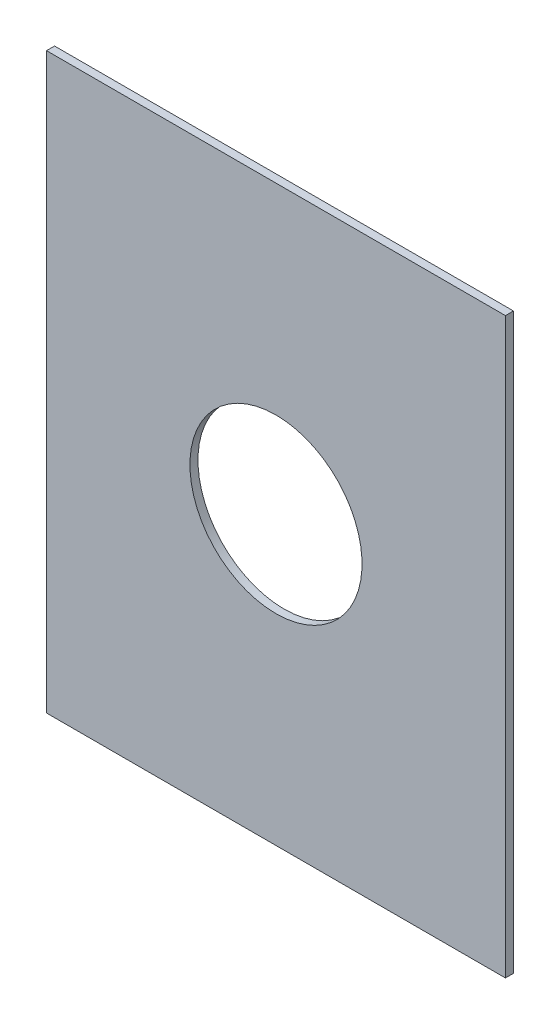
ISO-10303-21;
HEADER;
FILE_DESCRIPTION(('STEP AP214'),'2;1');
FILE_NAME('part.step','',(''),(''),'','','');
FILE_SCHEMA(('AUTOMOTIVE_DESIGN { 1 0 10303 214 1 1 1 1 }'));
ENDSEC;
DATA;
#1=APPLICATION_CONTEXT('core data for automotive mechanical design processes');
#2=APPLICATION_PROTOCOL_DEFINITION('international standard','automotive_design',2000,#1);
#3=PRODUCT_CONTEXT('',#1,'mechanical');
#4=PRODUCT('Part','Part','',(#3));
#5=PRODUCT_RELATED_PRODUCT_CATEGORY('part','',(#4));
#6=PRODUCT_DEFINITION_FORMATION('','',#4);
#7=PRODUCT_DEFINITION_CONTEXT('part definition',#1,'design');
#8=PRODUCT_DEFINITION('design','',#6,#7);
#9=PRODUCT_DEFINITION_SHAPE('','',#8);
#10=(LENGTH_UNIT() NAMED_UNIT(*) SI_UNIT(.MILLI.,.METRE.));
#11=(NAMED_UNIT(*) PLANE_ANGLE_UNIT() SI_UNIT($,.RADIAN.));
#12=(NAMED_UNIT(*) SI_UNIT($,.STERADIAN.) SOLID_ANGLE_UNIT());
#13=UNCERTAINTY_MEASURE_WITH_UNIT(LENGTH_MEASURE(1.E-05),#10,'distance_accuracy_value','');
#14=(GEOMETRIC_REPRESENTATION_CONTEXT(3) GLOBAL_UNCERTAINTY_ASSIGNED_CONTEXT((#13)) GLOBAL_UNIT_ASSIGNED_CONTEXT((#10,
#11,#12)) REPRESENTATION_CONTEXT('',''));
#15=CARTESIAN_POINT('',(0.,0.,0.));
#16=DIRECTION('',(0.,0.,1.));
#17=DIRECTION('',(1.,0.,0.));
#18=AXIS2_PLACEMENT_3D('',#15,#16,#17);
#19=CARTESIAN_POINT('',(121.92,-103.632,-0.045));
#20=DIRECTION('',(0.,0.,-1.));
#21=DIRECTION('',(0.,-1.,0.));
#22=AXIS2_PLACEMENT_3D('',#19,#20,#21);
#23=CYLINDRICAL_SURFACE('',#22,0.375);
#24=CARTESIAN_POINT('',(121.92,-103.632,-0.035));
#25=DIRECTION('',(0.,0.,-1.));
#26=DIRECTION('',(0.,-1.,0.));
#27=AXIS2_PLACEMENT_3D('',#24,#25,#26);
#28=CIRCLE('',#27,0.375);
#29=CARTESIAN_POINT('',(121.92,-104.007,-0.035));
#30=VERTEX_POINT('',#29);
#31=EDGE_CURVE('E129',#30,#30,#28,.T.);
#32=ORIENTED_EDGE('',*,*,#31,.T.);
#33=DIRECTION('',(0.,0.,1.));
#34=VECTOR('',#33,1.);
#35=CARTESIAN_POINT('',(121.92,-104.007,-0.045));
#36=LINE('',#35,#34);
#37=CARTESIAN_POINT('',(121.92,-104.007,0.));
#38=VERTEX_POINT('',#37);
#39=EDGE_CURVE('E11',#30,#38,#36,.T.);
#40=ORIENTED_EDGE('',*,*,#39,.T.);
#41=CARTESIAN_POINT('',(121.92,-103.632,0.));
#42=DIRECTION('',(0.,0.,-1.));
#43=DIRECTION('',(0.,-1.,0.));
#44=AXIS2_PLACEMENT_3D('',#41,#42,#43);
#45=CIRCLE('',#44,0.375);
#46=EDGE_CURVE('E20',#38,#38,#45,.T.);
#47=ORIENTED_EDGE('',*,*,#46,.F.);
#48=ORIENTED_EDGE('',*,*,#39,.F.);
#49=EDGE_LOOP('',(#32,#40,#47,#48));
#50=FACE_BOUND('',#49,.T.);
#51=ADVANCED_FACE('F17',(#50),#23,.F.);
#52=CARTESIAN_POINT('',(120.92,-102.382,-0.035));
#53=DIRECTION('',(0.,1.,0.));
#54=DIRECTION('',(1.,0.,0.));
#55=AXIS2_PLACEMENT_3D('',#52,#53,#54);
#56=PLANE('',#55);
#57=DIRECTION('',(0.,0.,1.));
#58=VECTOR('',#57,1.);
#59=CARTESIAN_POINT('',(120.92,-102.382,-0.035));
#60=LINE('',#59,#58);
#61=CARTESIAN_POINT('',(120.92,-102.382,-0.035));
#62=VERTEX_POINT('',#61);
#63=CARTESIAN_POINT('',(120.92,-102.382,0.));
#64=VERTEX_POINT('',#63);
#65=EDGE_CURVE('E116',#62,#64,#60,.T.);
#66=ORIENTED_EDGE('',*,*,#65,.T.);
#67=DIRECTION('',(1.,0.,0.));
#68=VECTOR('',#67,1.);
#69=CARTESIAN_POINT('',(120.92,-102.382,0.));
#70=LINE('',#69,#68);
#71=CARTESIAN_POINT('',(122.92,-102.382,0.));
#72=VERTEX_POINT('',#71);
#73=EDGE_CURVE('E131',#64,#72,#70,.T.);
#74=ORIENTED_EDGE('',*,*,#73,.T.);
#75=DIRECTION('',(0.,0.,1.));
#76=VECTOR('',#75,1.);
#77=CARTESIAN_POINT('',(122.92,-102.382,-0.035));
#78=LINE('',#77,#76);
#79=CARTESIAN_POINT('',(122.92,-102.382,-0.035));
#80=VERTEX_POINT('',#79);
#81=EDGE_CURVE('E99',#80,#72,#78,.T.);
#82=ORIENTED_EDGE('',*,*,#81,.F.);
#83=DIRECTION('',(1.,0.,0.));
#84=VECTOR('',#83,1.);
#85=CARTESIAN_POINT('',(120.92,-102.382,-0.035));
#86=LINE('',#85,#84);
#87=EDGE_CURVE('E82',#62,#80,#86,.T.);
#88=ORIENTED_EDGE('',*,*,#87,.F.);
#89=EDGE_LOOP('',(#66,#74,#82,#88));
#90=FACE_BOUND('',#89,.T.);
#91=ADVANCED_FACE('F144',(#90),#56,.T.);
#92=CARTESIAN_POINT('',(0.,0.,0.));
#93=DIRECTION('',(0.,0.,1.));
#94=DIRECTION('',(1.,0.,0.));
#95=AXIS2_PLACEMENT_3D('',#92,#93,#94);
#96=PLANE('',#95);
#97=ORIENTED_EDGE('',*,*,#46,.T.);
#98=EDGE_LOOP('',(#97));
#99=FACE_BOUND('',#98,.T.);
#100=DIRECTION('',(-1.,0.,0.));
#101=VECTOR('',#100,1.);
#102=CARTESIAN_POINT('',(122.92,-104.882,0.));
#103=LINE('',#102,#101);
#104=CARTESIAN_POINT('',(122.92,-104.882,0.));
#105=VERTEX_POINT('',#104);
#106=CARTESIAN_POINT('',(120.92,-104.882,0.));
#107=VERTEX_POINT('',#106);
#108=EDGE_CURVE('E105',#105,#107,#103,.T.);
#109=ORIENTED_EDGE('',*,*,#108,.F.);
#110=DIRECTION('',(0.,-1.,0.));
#111=VECTOR('',#110,1.);
#112=CARTESIAN_POINT('',(122.92,-102.382,0.));
#113=LINE('',#112,#111);
#114=EDGE_CURVE('E89',#72,#105,#113,.T.);
#115=ORIENTED_EDGE('',*,*,#114,.F.);
#116=ORIENTED_EDGE('',*,*,#73,.F.);
#117=DIRECTION('',(0.,1.,0.));
#118=VECTOR('',#117,1.);
#119=CARTESIAN_POINT('',(120.92,-104.882,0.));
#120=LINE('',#119,#118);
#121=EDGE_CURVE('E88',#107,#64,#120,.T.);
#122=ORIENTED_EDGE('',*,*,#121,.F.);
#123=EDGE_LOOP('',(#109,#115,#116,#122));
#124=FACE_BOUND('',#123,.T.);
#125=ADVANCED_FACE('F140',(#99,#124),#96,.T.);
#126=CARTESIAN_POINT('',(0.,0.,-0.035));
#127=DIRECTION('',(0.,0.,1.));
#128=DIRECTION('',(1.,0.,0.));
#129=AXIS2_PLACEMENT_3D('',#126,#127,#128);
#130=PLANE('',#129);
#131=ORIENTED_EDGE('',*,*,#31,.F.);
#132=EDGE_LOOP('',(#131));
#133=FACE_BOUND('',#132,.T.);
#134=DIRECTION('',(0.,1.,0.));
#135=VECTOR('',#134,1.);
#136=CARTESIAN_POINT('',(120.92,-104.882,-0.035));
#137=LINE('',#136,#135);
#138=CARTESIAN_POINT('',(120.92,-104.882,-0.035));
#139=VERTEX_POINT('',#138);
#140=EDGE_CURVE('E120',#139,#62,#137,.T.);
#141=ORIENTED_EDGE('',*,*,#140,.T.);
#142=ORIENTED_EDGE('',*,*,#87,.T.);
#143=DIRECTION('',(0.,-1.,0.));
#144=VECTOR('',#143,1.);
#145=CARTESIAN_POINT('',(122.92,-102.382,-0.035));
#146=LINE('',#145,#144);
#147=CARTESIAN_POINT('',(122.92,-104.882,-0.035));
#148=VERTEX_POINT('',#147);
#149=EDGE_CURVE('E76',#80,#148,#146,.T.);
#150=ORIENTED_EDGE('',*,*,#149,.T.);
#151=DIRECTION('',(-1.,0.,0.));
#152=VECTOR('',#151,1.);
#153=CARTESIAN_POINT('',(122.92,-104.882,-0.035));
#154=LINE('',#153,#152);
#155=EDGE_CURVE('E80',#148,#139,#154,.T.);
#156=ORIENTED_EDGE('',*,*,#155,.T.);
#157=EDGE_LOOP('',(#141,#142,#150,#156));
#158=FACE_BOUND('',#157,.T.);
#159=ADVANCED_FACE('F79',(#133,#158),#130,.F.);
#160=CARTESIAN_POINT('',(120.92,-104.882,-0.035));
#161=DIRECTION('',(-1.,0.,0.));
#162=DIRECTION('',(0.,0.,1.));
#163=AXIS2_PLACEMENT_3D('',#160,#161,#162);
#164=PLANE('',#163);
#165=DIRECTION('',(0.,0.,1.));
#166=VECTOR('',#165,1.);
#167=CARTESIAN_POINT('',(120.92,-104.882,-0.035));
#168=LINE('',#167,#166);
#169=EDGE_CURVE('E97',#139,#107,#168,.T.);
#170=ORIENTED_EDGE('',*,*,#169,.T.);
#171=ORIENTED_EDGE('',*,*,#121,.T.);
#172=ORIENTED_EDGE('',*,*,#65,.F.);
#173=ORIENTED_EDGE('',*,*,#140,.F.);
#174=EDGE_LOOP('',(#170,#171,#172,#173));
#175=FACE_BOUND('',#174,.T.);
#176=ADVANCED_FACE('F158',(#175),#164,.T.);
#177=CARTESIAN_POINT('',(122.92,-102.382,-0.035));
#178=DIRECTION('',(1.,0.,0.));
#179=DIRECTION('',(0.,1.,0.));
#180=AXIS2_PLACEMENT_3D('',#177,#178,#179);
#181=PLANE('',#180);
#182=ORIENTED_EDGE('',*,*,#81,.T.);
#183=ORIENTED_EDGE('',*,*,#114,.T.);
#184=DIRECTION('',(0.,0.,1.));
#185=VECTOR('',#184,1.);
#186=CARTESIAN_POINT('',(122.92,-104.882,-0.035));
#187=LINE('',#186,#185);
#188=EDGE_CURVE('E95',#148,#105,#187,.T.);
#189=ORIENTED_EDGE('',*,*,#188,.F.);
#190=ORIENTED_EDGE('',*,*,#149,.F.);
#191=EDGE_LOOP('',(#182,#183,#189,#190));
#192=FACE_BOUND('',#191,.T.);
#193=ADVANCED_FACE('F101',(#192),#181,.T.);
#194=CARTESIAN_POINT('',(122.92,-104.882,-0.035));
#195=DIRECTION('',(0.,-1.,0.));
#196=DIRECTION('',(0.,0.,-1.));
#197=AXIS2_PLACEMENT_3D('',#194,#195,#196);
#198=PLANE('',#197);
#199=ORIENTED_EDGE('',*,*,#188,.T.);
#200=ORIENTED_EDGE('',*,*,#108,.T.);
#201=ORIENTED_EDGE('',*,*,#169,.F.);
#202=ORIENTED_EDGE('',*,*,#155,.F.);
#203=EDGE_LOOP('',(#199,#200,#201,#202));
#204=FACE_BOUND('',#203,.T.);
#205=ADVANCED_FACE('F93',(#204),#198,.T.);
#206=CLOSED_SHELL('',(#51,#91,#125,#159,#176,#193,#205));
#207=MANIFOLD_SOLID_BREP('B1',#206);
#208=ADVANCED_BREP_SHAPE_REPRESENTATION('',(#18,#207),#14);
#209=SHAPE_DEFINITION_REPRESENTATION(#9,#208);
ENDSEC;
END-ISO-10303-21;
